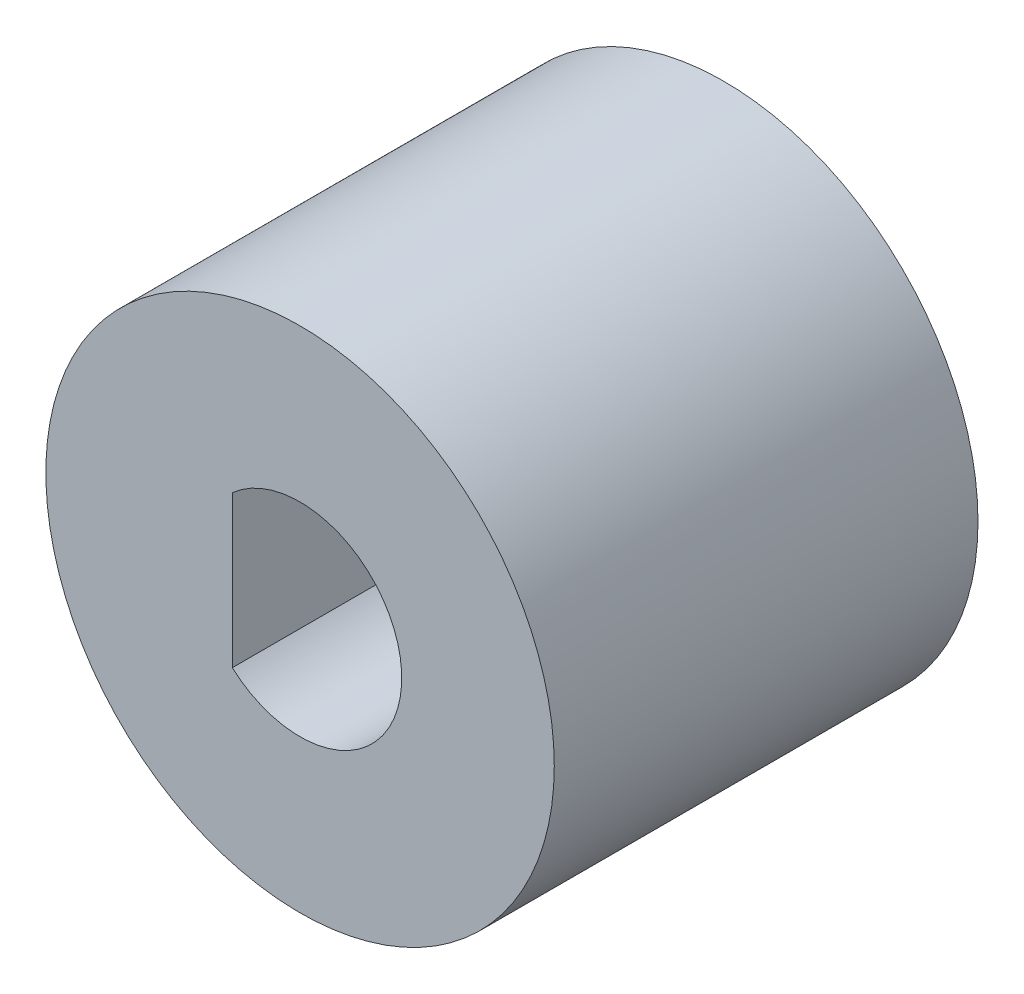
ISO-10303-21;
HEADER;
FILE_DESCRIPTION(('STEP AP214'),'2;1');
FILE_NAME('part.step','',(''),(''),'','','');
FILE_SCHEMA(('AUTOMOTIVE_DESIGN { 1 0 10303 214 1 1 1 1 }'));
ENDSEC;
DATA;
#1=APPLICATION_CONTEXT('core data for automotive mechanical design processes');
#2=APPLICATION_PROTOCOL_DEFINITION('international standard','automotive_design',2000,#1);
#3=PRODUCT_CONTEXT('',#1,'mechanical');
#4=PRODUCT('Part','Part','',(#3));
#5=PRODUCT_RELATED_PRODUCT_CATEGORY('part','',(#4));
#6=PRODUCT_DEFINITION_FORMATION('','',#4);
#7=PRODUCT_DEFINITION_CONTEXT('part definition',#1,'design');
#8=PRODUCT_DEFINITION('design','',#6,#7);
#9=PRODUCT_DEFINITION_SHAPE('','',#8);
#10=(LENGTH_UNIT() NAMED_UNIT(*) SI_UNIT(.MILLI.,.METRE.));
#11=(NAMED_UNIT(*) PLANE_ANGLE_UNIT() SI_UNIT($,.RADIAN.));
#12=(NAMED_UNIT(*) SI_UNIT($,.STERADIAN.) SOLID_ANGLE_UNIT());
#13=UNCERTAINTY_MEASURE_WITH_UNIT(LENGTH_MEASURE(1.E-05),#10,'distance_accuracy_value','');
#14=(GEOMETRIC_REPRESENTATION_CONTEXT(3) GLOBAL_UNCERTAINTY_ASSIGNED_CONTEXT((#13)) GLOBAL_UNIT_ASSIGNED_CONTEXT((#10,
#11,#12)) REPRESENTATION_CONTEXT('',''));
#15=CARTESIAN_POINT('',(0.,0.,0.));
#16=DIRECTION('',(0.,0.,1.));
#17=DIRECTION('',(1.,0.,0.));
#18=AXIS2_PLACEMENT_3D('',#15,#16,#17);
#19=CARTESIAN_POINT('',(0.,0.,25.));
#20=DIRECTION('',(0.,0.,-1.));
#21=DIRECTION('',(-1.,0.,0.));
#22=AXIS2_PLACEMENT_3D('',#19,#20,#21);
#23=CYLINDRICAL_SURFACE('',#22,6.);
#24=CARTESIAN_POINT('',(0.,0.,0.));
#25=DIRECTION('',(0.,0.,1.));
#26=DIRECTION('',(1.,0.,0.));
#27=AXIS2_PLACEMENT_3D('',#24,#25,#26);
#28=CIRCLE('',#27,6.);
#29=CARTESIAN_POINT('',(-4.,-4.47213595499958,0.));
#30=VERTEX_POINT('',#29);
#31=CARTESIAN_POINT('',(-4.,4.47213595499958,0.));
#32=VERTEX_POINT('',#31);
#33=EDGE_CURVE('E66',#30,#32,#28,.T.);
#34=ORIENTED_EDGE('',*,*,#33,.F.);
#35=DIRECTION('',(0.,0.,-1.));
#36=VECTOR('',#35,1.);
#37=CARTESIAN_POINT('',(-4.,-4.47213595499958,25.));
#38=LINE('',#37,#36);
#39=CARTESIAN_POINT('',(-4.,-4.47213595499958,25.));
#40=VERTEX_POINT('',#39);
#41=EDGE_CURVE('E11',#40,#30,#38,.T.);
#42=ORIENTED_EDGE('',*,*,#41,.F.);
#43=CARTESIAN_POINT('',(0.,0.,25.));
#44=DIRECTION('',(0.,0.,1.));
#45=DIRECTION('',(1.,0.,0.));
#46=AXIS2_PLACEMENT_3D('',#43,#44,#45);
#47=CIRCLE('',#46,6.);
#48=CARTESIAN_POINT('',(-4.,4.47213595499958,25.));
#49=VERTEX_POINT('',#48);
#50=EDGE_CURVE('E69',#40,#49,#47,.T.);
#51=ORIENTED_EDGE('',*,*,#50,.T.);
#52=DIRECTION('',(0.,0.,-1.));
#53=VECTOR('',#52,1.);
#54=CARTESIAN_POINT('',(-4.,4.47213595499958,25.));
#55=LINE('',#54,#53);
#56=EDGE_CURVE('E51',#49,#32,#55,.T.);
#57=ORIENTED_EDGE('',*,*,#56,.T.);
#58=EDGE_LOOP('',(#34,#42,#51,#57));
#59=FACE_BOUND('',#58,.T.);
#60=ADVANCED_FACE('F43',(#59),#23,.F.);
#61=CARTESIAN_POINT('',(-4.,0.,25.));
#62=DIRECTION('',(1.,0.,0.));
#63=DIRECTION('',(0.,0.,-1.));
#64=AXIS2_PLACEMENT_3D('',#61,#62,#63);
#65=PLANE('',#64);
#66=DIRECTION('',(0.,-1.,0.));
#67=VECTOR('',#66,1.);
#68=CARTESIAN_POINT('',(-4.,0.,0.));
#69=LINE('',#68,#67);
#70=EDGE_CURVE('E75',#32,#30,#69,.T.);
#71=ORIENTED_EDGE('',*,*,#70,.F.);
#72=ORIENTED_EDGE('',*,*,#56,.F.);
#73=DIRECTION('',(0.,-1.,0.));
#74=VECTOR('',#73,1.);
#75=CARTESIAN_POINT('',(-4.,0.,25.));
#76=LINE('',#75,#74);
#77=EDGE_CURVE('E85',#49,#40,#76,.T.);
#78=ORIENTED_EDGE('',*,*,#77,.T.);
#79=ORIENTED_EDGE('',*,*,#41,.T.);
#80=EDGE_LOOP('',(#71,#72,#78,#79));
#81=FACE_BOUND('',#80,.T.);
#82=ADVANCED_FACE('F77',(#81),#65,.T.);
#83=CARTESIAN_POINT('',(0.,0.,25.));
#84=DIRECTION('',(0.,0.,-1.));
#85=DIRECTION('',(-1.,0.,0.));
#86=AXIS2_PLACEMENT_3D('',#83,#84,#85);
#87=CYLINDRICAL_SURFACE('',#86,15.);
#88=CARTESIAN_POINT('',(0.,0.,25.));
#89=DIRECTION('',(0.,0.,1.));
#90=DIRECTION('',(1.,0.,0.));
#91=AXIS2_PLACEMENT_3D('',#88,#89,#90);
#92=CIRCLE('',#91,15.);
#93=CARTESIAN_POINT('',(15.,0.,25.));
#94=VERTEX_POINT('',#93);
#95=EDGE_CURVE('E71',#94,#94,#92,.T.);
#96=ORIENTED_EDGE('',*,*,#95,.F.);
#97=EDGE_LOOP('',(#96));
#98=FACE_BOUND('',#97,.T.);
#99=CARTESIAN_POINT('',(0.,0.,0.));
#100=DIRECTION('',(0.,0.,1.));
#101=DIRECTION('',(1.,0.,0.));
#102=AXIS2_PLACEMENT_3D('',#99,#100,#101);
#103=CIRCLE('',#102,15.);
#104=CARTESIAN_POINT('',(15.,0.,0.));
#105=VERTEX_POINT('',#104);
#106=EDGE_CURVE('E78',#105,#105,#103,.T.);
#107=ORIENTED_EDGE('',*,*,#106,.T.);
#108=EDGE_LOOP('',(#107));
#109=FACE_BOUND('',#108,.T.);
#110=ADVANCED_FACE('F91',(#98,#109),#87,.T.);
#111=CARTESIAN_POINT('',(0.,0.,25.));
#112=DIRECTION('',(0.,0.,1.));
#113=DIRECTION('',(1.,0.,0.));
#114=AXIS2_PLACEMENT_3D('',#111,#112,#113);
#115=PLANE('',#114);
#116=ORIENTED_EDGE('',*,*,#50,.F.);
#117=ORIENTED_EDGE('',*,*,#77,.F.);
#118=EDGE_LOOP('',(#116,#117));
#119=FACE_BOUND('',#118,.T.);
#120=ORIENTED_EDGE('',*,*,#95,.T.);
#121=EDGE_LOOP('',(#120));
#122=FACE_BOUND('',#121,.T.);
#123=ADVANCED_FACE('F88',(#119,#122),#115,.T.);
#124=CARTESIAN_POINT('',(0.,0.,0.));
#125=DIRECTION('',(0.,0.,1.));
#126=DIRECTION('',(1.,0.,0.));
#127=AXIS2_PLACEMENT_3D('',#124,#125,#126);
#128=PLANE('',#127);
#129=ORIENTED_EDGE('',*,*,#33,.T.);
#130=ORIENTED_EDGE('',*,*,#70,.T.);
#131=EDGE_LOOP('',(#129,#130));
#132=FACE_BOUND('',#131,.T.);
#133=ORIENTED_EDGE('',*,*,#106,.F.);
#134=EDGE_LOOP('',(#133));
#135=FACE_BOUND('',#134,.T.);
#136=ADVANCED_FACE('F73',(#132,#135),#128,.F.);
#137=CLOSED_SHELL('',(#60,#82,#110,#123,#136));
#138=MANIFOLD_SOLID_BREP('B2',#137);
#139=ADVANCED_BREP_SHAPE_REPRESENTATION('',(#18,#138),#14);
#140=SHAPE_DEFINITION_REPRESENTATION(#9,#139);
ENDSEC;
END-ISO-10303-21;
